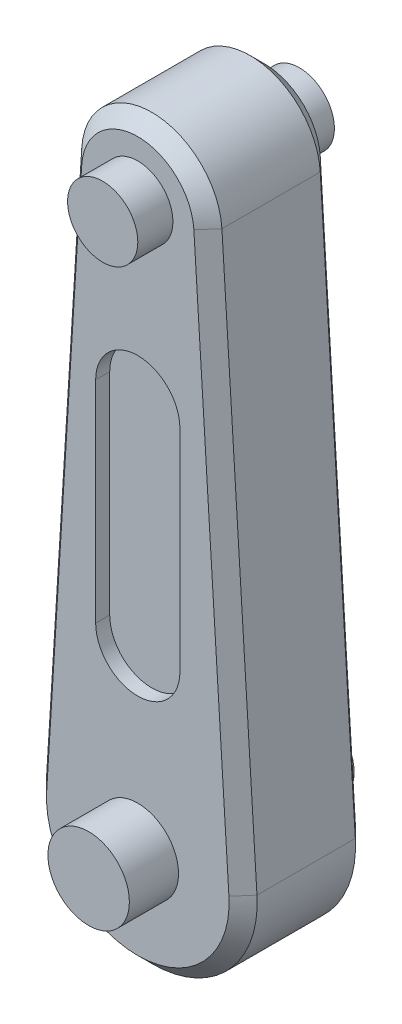
ISO-10303-21;
HEADER;
FILE_DESCRIPTION(('STEP AP214'),'2;1');
FILE_NAME('part.step','',(''),(''),'','','');
FILE_SCHEMA(('AUTOMOTIVE_DESIGN { 1 0 10303 214 1 1 1 1 }'));
ENDSEC;
DATA;
#1=APPLICATION_CONTEXT('core data for automotive mechanical design processes');
#2=APPLICATION_PROTOCOL_DEFINITION('international standard','automotive_design',2000,#1);
#3=PRODUCT_CONTEXT('',#1,'mechanical');
#4=PRODUCT('Part','Part','',(#3));
#5=PRODUCT_RELATED_PRODUCT_CATEGORY('part','',(#4));
#6=PRODUCT_DEFINITION_FORMATION('','',#4);
#7=PRODUCT_DEFINITION_CONTEXT('part definition',#1,'design');
#8=PRODUCT_DEFINITION('design','',#6,#7);
#9=PRODUCT_DEFINITION_SHAPE('','',#8);
#10=(LENGTH_UNIT() NAMED_UNIT(*) SI_UNIT(.MILLI.,.METRE.));
#11=(NAMED_UNIT(*) PLANE_ANGLE_UNIT() SI_UNIT($,.RADIAN.));
#12=(NAMED_UNIT(*) SI_UNIT($,.STERADIAN.) SOLID_ANGLE_UNIT());
#13=UNCERTAINTY_MEASURE_WITH_UNIT(LENGTH_MEASURE(1.E-05),#10,'distance_accuracy_value','');
#14=(GEOMETRIC_REPRESENTATION_CONTEXT(3) GLOBAL_UNCERTAINTY_ASSIGNED_CONTEXT((#13)) GLOBAL_UNIT_ASSIGNED_CONTEXT((#10,
#11,#12)) REPRESENTATION_CONTEXT('',''));
#15=CARTESIAN_POINT('',(0.,0.,0.));
#16=DIRECTION('',(0.,0.,1.));
#17=DIRECTION('',(1.,0.,0.));
#18=AXIS2_PLACEMENT_3D('',#15,#16,#17);
#19=CARTESIAN_POINT('',(0.,0.,-45.));
#20=DIRECTION('',(0.,0.,1.));
#21=DIRECTION('',(1.,0.,0.));
#22=AXIS2_PLACEMENT_3D('',#19,#20,#21);
#23=PLANE('',#22);
#24=CARTESIAN_POINT('',(0.,0.,-45.));
#25=DIRECTION('',(0.,0.,1.));
#26=DIRECTION('',(1.,0.,0.));
#27=AXIS2_PLACEMENT_3D('',#24,#25,#26);
#28=CIRCLE('',#27,29.);
#29=CARTESIAN_POINT('',(29.,0.,-45.));
#30=VERTEX_POINT('',#29);
#31=EDGE_CURVE('E245',#30,#30,#28,.F.);
#32=ORIENTED_EDGE('',*,*,#31,.F.);
#33=EDGE_LOOP('',(#32));
#34=FACE_BOUND('',#33,.T.);
#35=CARTESIAN_POINT('',(0.,400.,-45.));
#36=DIRECTION('',(0.,0.,1.));
#37=DIRECTION('',(1.,0.,0.));
#38=AXIS2_PLACEMENT_3D('',#35,#36,#37);
#39=CIRCLE('',#38,25.);
#40=CARTESIAN_POINT('',(25.,400.,-45.));
#41=VERTEX_POINT('',#40);
#42=EDGE_CURVE('E257',#41,#41,#39,.F.);
#43=ORIENTED_EDGE('',*,*,#42,.F.);
#44=EDGE_LOOP('',(#43));
#45=FACE_BOUND('',#44,.T.);
#46=CARTESIAN_POINT('',(0.,0.,-45.));
#47=DIRECTION('',(0.,0.,1.));
#48=DIRECTION('',(1.,0.,0.));
#49=AXIS2_PLACEMENT_3D('',#46,#47,#48);
#50=CIRCLE('',#49,65.);
#51=CARTESIAN_POINT('',(64.8729226546022,4.0625,-45.));
#52=VERTEX_POINT('',#51);
#53=CARTESIAN_POINT('',(-64.8729226546022,4.0625,-45.));
#54=VERTEX_POINT('',#53);
#55=EDGE_CURVE('E48',#52,#54,#50,.F.);
#56=ORIENTED_EDGE('',*,*,#55,.T.);
#57=DIRECTION('',(0.0625,0.998044963916957,0.));
#58=VECTOR('',#57,1.);
#59=CARTESIAN_POINT('',(-64.8729226546022,4.0625,-45.));
#60=LINE('',#59,#58);
#61=CARTESIAN_POINT('',(-39.9217985566783,402.5,-45.));
#62=VERTEX_POINT('',#61);
#63=EDGE_CURVE('E11',#54,#62,#60,.T.);
#64=ORIENTED_EDGE('',*,*,#63,.T.);
#65=CARTESIAN_POINT('',(0.,400.,-45.));
#66=DIRECTION('',(0.,0.,1.));
#67=DIRECTION('',(1.,0.,0.));
#68=AXIS2_PLACEMENT_3D('',#65,#66,#67);
#69=CIRCLE('',#68,40.);
#70=CARTESIAN_POINT('',(39.9217985566783,402.5,-45.));
#71=VERTEX_POINT('',#70);
#72=EDGE_CURVE('E289',#62,#71,#69,.F.);
#73=ORIENTED_EDGE('',*,*,#72,.T.);
#74=DIRECTION('',(0.0625,-0.998044963916957,0.));
#75=VECTOR('',#74,1.);
#76=CARTESIAN_POINT('',(64.8729226546022,4.0625,-45.));
#77=LINE('',#76,#75);
#78=EDGE_CURVE('E287',#71,#52,#77,.T.);
#79=ORIENTED_EDGE('',*,*,#78,.T.);
#80=EDGE_LOOP('',(#56,#64,#73,#79));
#81=FACE_BOUND('',#80,.T.);
#82=CARTESIAN_POINT('',(0.,275.,-45.));
#83=DIRECTION('',(0.,0.,1.));
#84=DIRECTION('',(1.,0.,0.));
#85=AXIS2_PLACEMENT_3D('',#82,#83,#84);
#86=CIRCLE('',#85,30.);
#87=CARTESIAN_POINT('',(30.,275.,-45.));
#88=VERTEX_POINT('',#87);
#89=CARTESIAN_POINT('',(-30.,275.,-45.));
#90=VERTEX_POINT('',#89);
#91=EDGE_CURVE('E56',#88,#90,#86,.T.);
#92=ORIENTED_EDGE('',*,*,#91,.T.);
#93=DIRECTION('',(0.,-1.,0.));
#94=VECTOR('',#93,1.);
#95=CARTESIAN_POINT('',(-30.,275.,-45.));
#96=LINE('',#95,#94);
#97=CARTESIAN_POINT('',(-30.,125.,-45.));
#98=VERTEX_POINT('',#97);
#99=EDGE_CURVE('E174',#90,#98,#96,.T.);
#100=ORIENTED_EDGE('',*,*,#99,.T.);
#101=CARTESIAN_POINT('',(0.,125.,-45.));
#102=DIRECTION('',(0.,0.,1.));
#103=DIRECTION('',(1.,0.,0.));
#104=AXIS2_PLACEMENT_3D('',#101,#102,#103);
#105=CIRCLE('',#104,30.);
#106=CARTESIAN_POINT('',(30.,125.,-45.));
#107=VERTEX_POINT('',#106);
#108=EDGE_CURVE('E177',#98,#107,#105,.T.);
#109=ORIENTED_EDGE('',*,*,#108,.T.);
#110=DIRECTION('',(0.,1.,0.));
#111=VECTOR('',#110,1.);
#112=CARTESIAN_POINT('',(30.,275.,-45.));
#113=LINE('',#112,#111);
#114=EDGE_CURVE('E183',#107,#88,#113,.T.);
#115=ORIENTED_EDGE('',*,*,#114,.T.);
#116=EDGE_LOOP('',(#92,#100,#109,#115));
#117=FACE_BOUND('',#116,.T.);
#118=ADVANCED_FACE('F38',(#34,#45,#81,#117),#23,.F.);
#119=CARTESIAN_POINT('',(0.,0.,-162.02438661764));
#120=DIRECTION('',(0.,0.,1.));
#121=DIRECTION('',(1.,0.,0.));
#122=AXIS2_PLACEMENT_3D('',#119,#120,#121);
#123=CYLINDRICAL_SURFACE('',#122,29.);
#124=CARTESIAN_POINT('',(0.,0.,45.));
#125=DIRECTION('',(0.,0.,1.));
#126=DIRECTION('',(1.,0.,0.));
#127=AXIS2_PLACEMENT_3D('',#124,#125,#126);
#128=CIRCLE('',#127,29.);
#129=CARTESIAN_POINT('',(29.,0.,45.));
#130=VERTEX_POINT('',#129);
#131=EDGE_CURVE('E252',#130,#130,#128,.F.);
#132=ORIENTED_EDGE('',*,*,#131,.F.);
#133=EDGE_LOOP('',(#132));
#134=FACE_BOUND('',#133,.T.);
#135=CARTESIAN_POINT('',(0.,0.,80.));
#136=DIRECTION('',(0.,0.,1.));
#137=DIRECTION('',(1.,0.,0.));
#138=AXIS2_PLACEMENT_3D('',#135,#136,#137);
#139=CIRCLE('',#138,29.);
#140=CARTESIAN_POINT('',(29.,0.,80.));
#141=VERTEX_POINT('',#140);
#142=EDGE_CURVE('E246',#141,#141,#139,.T.);
#143=ORIENTED_EDGE('',*,*,#142,.F.);
#144=EDGE_LOOP('',(#143));
#145=FACE_BOUND('',#144,.T.);
#146=ADVANCED_FACE('F370',(#134,#145),#123,.T.);
#147=CARTESIAN_POINT('',(0.,0.,80.));
#148=DIRECTION('',(0.,0.,1.));
#149=DIRECTION('',(1.,0.,0.));
#150=AXIS2_PLACEMENT_3D('',#147,#148,#149);
#151=PLANE('',#150);
#152=ORIENTED_EDGE('',*,*,#142,.T.);
#153=EDGE_LOOP('',(#152));
#154=FACE_BOUND('',#153,.T.);
#155=ADVANCED_FACE('F373',(#154),#151,.T.);
#156=CARTESIAN_POINT('',(0.,0.,45.));
#157=DIRECTION('',(0.,0.,-1.));
#158=DIRECTION('',(-1.,0.,0.));
#159=AXIS2_PLACEMENT_3D('',#156,#157,#158);
#160=CYLINDRICAL_SURFACE('',#159,75.);
#161=DIRECTION('',(0.,0.,-1.));
#162=VECTOR('',#161,1.);
#163=CARTESIAN_POINT('',(74.8533722937718,4.6875,45.));
#164=LINE('',#163,#162);
#165=CARTESIAN_POINT('',(74.8533722937718,4.6875,34.9999999999999));
#166=VERTEX_POINT('',#165);
#167=CARTESIAN_POINT('',(74.8533722937718,4.6875,-35.0000000000001));
#168=VERTEX_POINT('',#167);
#169=EDGE_CURVE('E242',#166,#168,#164,.T.);
#170=ORIENTED_EDGE('',*,*,#169,.F.);
#171=CARTESIAN_POINT('',(0.,0.,34.9999999999999));
#172=DIRECTION('',(0.,0.,1.));
#173=DIRECTION('',(1.,0.,0.));
#174=AXIS2_PLACEMENT_3D('',#171,#172,#173);
#175=CIRCLE('',#174,75.);
#176=CARTESIAN_POINT('',(-74.8533722937718,4.68749999999999,34.9999999999999));
#177=VERTEX_POINT('',#176);
#178=EDGE_CURVE('E277',#166,#177,#175,.F.);
#179=ORIENTED_EDGE('',*,*,#178,.T.);
#180=DIRECTION('',(0.,0.,-1.));
#181=VECTOR('',#180,1.);
#182=CARTESIAN_POINT('',(-74.8533722937718,4.68749999999999,45.));
#183=LINE('',#182,#181);
#184=CARTESIAN_POINT('',(-74.8533722937718,4.68749999999999,-35.0000000000001));
#185=VERTEX_POINT('',#184);
#186=EDGE_CURVE('E233',#177,#185,#183,.T.);
#187=ORIENTED_EDGE('',*,*,#186,.T.);
#188=CARTESIAN_POINT('',(0.,0.,-35.0000000000001));
#189=DIRECTION('',(0.,0.,1.));
#190=DIRECTION('',(1.,0.,0.));
#191=AXIS2_PLACEMENT_3D('',#188,#189,#190);
#192=CIRCLE('',#191,75.);
#193=EDGE_CURVE('E275',#185,#168,#192,.T.);
#194=ORIENTED_EDGE('',*,*,#193,.T.);
#195=EDGE_LOOP('',(#170,#179,#187,#194));
#196=FACE_BOUND('',#195,.T.);
#197=ADVANCED_FACE('F334',(#196),#160,.T.);
#198=CARTESIAN_POINT('',(49.9022481958478,403.125,45.));
#199=DIRECTION('',(-0.998044963916957,-0.0625,0.));
#200=DIRECTION('',(0.0625,-0.998044963916957,0.));
#201=AXIS2_PLACEMENT_3D('',#198,#199,#200);
#202=PLANE('',#201);
#203=DIRECTION('',(0.,0.,-1.));
#204=VECTOR('',#203,1.);
#205=CARTESIAN_POINT('',(49.9022481958479,403.125,45.));
#206=LINE('',#205,#204);
#207=CARTESIAN_POINT('',(49.9022481958479,403.125,34.9999999999999));
#208=VERTEX_POINT('',#207);
#209=CARTESIAN_POINT('',(49.9022481958479,403.125,-35.0000000000001));
#210=VERTEX_POINT('',#209);
#211=EDGE_CURVE('E239',#208,#210,#206,.T.);
#212=ORIENTED_EDGE('',*,*,#211,.F.);
#213=DIRECTION('',(0.0625,-0.998044963916957,0.));
#214=VECTOR('',#213,1.);
#215=CARTESIAN_POINT('',(74.8533722937718,4.6875,34.9999999999999));
#216=LINE('',#215,#214);
#217=EDGE_CURVE('E285',#208,#166,#216,.T.);
#218=ORIENTED_EDGE('',*,*,#217,.T.);
#219=ORIENTED_EDGE('',*,*,#169,.T.);
#220=DIRECTION('',(-0.0625,0.998044963916957,0.));
#221=VECTOR('',#220,1.);
#222=CARTESIAN_POINT('',(49.9022481958478,403.125,-35.0000000000001));
#223=LINE('',#222,#221);
#224=EDGE_CURVE('E283',#168,#210,#223,.T.);
#225=ORIENTED_EDGE('',*,*,#224,.T.);
#226=EDGE_LOOP('',(#212,#218,#219,#225));
#227=FACE_BOUND('',#226,.T.);
#228=ADVANCED_FACE('F351',(#227),#202,.F.);
#229=CARTESIAN_POINT('',(0.,400.,45.));
#230=DIRECTION('',(0.,0.,-1.));
#231=DIRECTION('',(-1.,0.,0.));
#232=AXIS2_PLACEMENT_3D('',#229,#230,#231);
#233=CYLINDRICAL_SURFACE('',#232,50.);
#234=DIRECTION('',(0.,0.,-1.));
#235=VECTOR('',#234,1.);
#236=CARTESIAN_POINT('',(-49.9022481958479,403.125,45.));
#237=LINE('',#236,#235);
#238=CARTESIAN_POINT('',(-49.9022481958479,403.125,34.9999999999999));
#239=VERTEX_POINT('',#238);
#240=CARTESIAN_POINT('',(-49.9022481958479,403.125,-35.0000000000001));
#241=VERTEX_POINT('',#240);
#242=EDGE_CURVE('E236',#239,#241,#237,.T.);
#243=ORIENTED_EDGE('',*,*,#242,.F.);
#244=CARTESIAN_POINT('',(0.,400.,34.9999999999999));
#245=DIRECTION('',(0.,0.,1.));
#246=DIRECTION('',(1.,0.,0.));
#247=AXIS2_PLACEMENT_3D('',#244,#245,#246);
#248=CIRCLE('',#247,50.);
#249=EDGE_CURVE('E281',#239,#208,#248,.F.);
#250=ORIENTED_EDGE('',*,*,#249,.T.);
#251=ORIENTED_EDGE('',*,*,#211,.T.);
#252=CARTESIAN_POINT('',(0.,400.,-35.0000000000001));
#253=DIRECTION('',(0.,0.,1.));
#254=DIRECTION('',(1.,0.,0.));
#255=AXIS2_PLACEMENT_3D('',#252,#253,#254);
#256=CIRCLE('',#255,50.);
#257=EDGE_CURVE('E279',#210,#241,#256,.T.);
#258=ORIENTED_EDGE('',*,*,#257,.T.);
#259=EDGE_LOOP('',(#243,#250,#251,#258));
#260=FACE_BOUND('',#259,.T.);
#261=ADVANCED_FACE('F347',(#260),#233,.T.);
#262=CARTESIAN_POINT('',(-74.8533722937718,4.68749999999999,45.));
#263=DIRECTION('',(0.998044963916957,-0.0625,0.));
#264=DIRECTION('',(0.0625,0.998044963916957,0.));
#265=AXIS2_PLACEMENT_3D('',#262,#263,#264);
#266=PLANE('',#265);
#267=ORIENTED_EDGE('',*,*,#186,.F.);
#268=DIRECTION('',(0.0625,0.998044963916957,0.));
#269=VECTOR('',#268,1.);
#270=CARTESIAN_POINT('',(-49.9022481958479,403.125,34.9999999999999));
#271=LINE('',#270,#269);
#272=EDGE_CURVE('E272',#177,#239,#271,.T.);
#273=ORIENTED_EDGE('',*,*,#272,.T.);
#274=ORIENTED_EDGE('',*,*,#242,.T.);
#275=DIRECTION('',(-0.0625,-0.998044963916957,0.));
#276=VECTOR('',#275,1.);
#277=CARTESIAN_POINT('',(-74.8533722937718,4.68749999999999,-35.0000000000001));
#278=LINE('',#277,#276);
#279=EDGE_CURVE('E269',#241,#185,#278,.T.);
#280=ORIENTED_EDGE('',*,*,#279,.T.);
#281=EDGE_LOOP('',(#267,#273,#274,#280));
#282=FACE_BOUND('',#281,.T.);
#283=ADVANCED_FACE('F331',(#282),#266,.F.);
#284=CARTESIAN_POINT('',(0.,0.,45.));
#285=DIRECTION('',(0.,0.,1.));
#286=DIRECTION('',(1.,0.,0.));
#287=AXIS2_PLACEMENT_3D('',#284,#285,#286);
#288=PLANE('',#287);
#289=CARTESIAN_POINT('',(0.,275.,45.));
#290=DIRECTION('',(0.,0.,1.));
#291=DIRECTION('',(1.,0.,0.));
#292=AXIS2_PLACEMENT_3D('',#289,#290,#291);
#293=CIRCLE('',#292,30.);
#294=CARTESIAN_POINT('',(30.,275.,45.));
#295=VERTEX_POINT('',#294);
#296=CARTESIAN_POINT('',(-30.,275.,45.));
#297=VERTEX_POINT('',#296);
#298=EDGE_CURVE('E64',#295,#297,#293,.T.);
#299=ORIENTED_EDGE('',*,*,#298,.F.);
#300=DIRECTION('',(0.,1.,0.));
#301=VECTOR('',#300,1.);
#302=CARTESIAN_POINT('',(30.,275.,45.));
#303=LINE('',#302,#301);
#304=CARTESIAN_POINT('',(30.,125.,45.));
#305=VERTEX_POINT('',#304);
#306=EDGE_CURVE('E196',#305,#295,#303,.T.);
#307=ORIENTED_EDGE('',*,*,#306,.F.);
#308=CARTESIAN_POINT('',(0.,125.,45.));
#309=DIRECTION('',(0.,0.,1.));
#310=DIRECTION('',(1.,0.,0.));
#311=AXIS2_PLACEMENT_3D('',#308,#309,#310);
#312=CIRCLE('',#311,30.);
#313=CARTESIAN_POINT('',(-30.,125.,45.));
#314=VERTEX_POINT('',#313);
#315=EDGE_CURVE('E210',#314,#305,#312,.T.);
#316=ORIENTED_EDGE('',*,*,#315,.F.);
#317=DIRECTION('',(0.,-1.,0.));
#318=VECTOR('',#317,1.);
#319=CARTESIAN_POINT('',(-30.,275.,45.));
#320=LINE('',#319,#318);
#321=EDGE_CURVE('E207',#297,#314,#320,.T.);
#322=ORIENTED_EDGE('',*,*,#321,.F.);
#323=EDGE_LOOP('',(#299,#307,#316,#322));
#324=FACE_BOUND('',#323,.T.);
#325=CARTESIAN_POINT('',(0.,400.,45.));
#326=DIRECTION('',(0.,0.,1.));
#327=DIRECTION('',(1.,0.,0.));
#328=AXIS2_PLACEMENT_3D('',#325,#326,#327);
#329=CIRCLE('',#328,40.);
#330=CARTESIAN_POINT('',(39.9217985566782,402.5,45.));
#331=VERTEX_POINT('',#330);
#332=CARTESIAN_POINT('',(-39.9217985566782,402.5,45.));
#333=VERTEX_POINT('',#332);
#334=EDGE_CURVE('E262',#331,#333,#329,.T.);
#335=ORIENTED_EDGE('',*,*,#334,.T.);
#336=DIRECTION('',(-0.0625,-0.998044963916957,0.));
#337=VECTOR('',#336,1.);
#338=CARTESIAN_POINT('',(-64.8729226546022,4.06249999999999,45.));
#339=LINE('',#338,#337);
#340=CARTESIAN_POINT('',(-64.8729226546022,4.06249999999999,45.));
#341=VERTEX_POINT('',#340);
#342=EDGE_CURVE('E266',#333,#341,#339,.T.);
#343=ORIENTED_EDGE('',*,*,#342,.T.);
#344=CARTESIAN_POINT('',(0.,0.,45.));
#345=DIRECTION('',(0.,0.,1.));
#346=DIRECTION('',(1.,0.,0.));
#347=AXIS2_PLACEMENT_3D('',#344,#345,#346);
#348=CIRCLE('',#347,65.);
#349=CARTESIAN_POINT('',(64.8729226546022,4.0625,45.));
#350=VERTEX_POINT('',#349);
#351=EDGE_CURVE('E264',#341,#350,#348,.T.);
#352=ORIENTED_EDGE('',*,*,#351,.T.);
#353=DIRECTION('',(-0.0625,0.998044963916957,0.));
#354=VECTOR('',#353,1.);
#355=CARTESIAN_POINT('',(39.9217985566782,402.5,45.));
#356=LINE('',#355,#354);
#357=EDGE_CURVE('E260',#350,#331,#356,.T.);
#358=ORIENTED_EDGE('',*,*,#357,.T.);
#359=EDGE_LOOP('',(#335,#343,#352,#358));
#360=FACE_BOUND('',#359,.T.);
#361=CARTESIAN_POINT('',(0.,400.,45.));
#362=DIRECTION('',(0.,0.,1.));
#363=DIRECTION('',(1.,0.,0.));
#364=AXIS2_PLACEMENT_3D('',#361,#362,#363);
#365=CIRCLE('',#364,25.);
#366=CARTESIAN_POINT('',(25.,400.,45.));
#367=VERTEX_POINT('',#366);
#368=EDGE_CURVE('E226',#367,#367,#365,.F.);
#369=ORIENTED_EDGE('',*,*,#368,.T.);
#370=EDGE_LOOP('',(#369));
#371=FACE_BOUND('',#370,.T.);
#372=ORIENTED_EDGE('',*,*,#131,.T.);
#373=EDGE_LOOP('',(#372));
#374=FACE_BOUND('',#373,.T.);
#375=ADVANCED_FACE('F360',(#324,#360,#371,#374),#288,.T.);
#376=CARTESIAN_POINT('',(-115.,-165.,-80.));
#377=DIRECTION('',(0.,0.,1.));
#378=DIRECTION('',(1.,0.,0.));
#379=AXIS2_PLACEMENT_3D('',#376,#377,#378);
#380=PLANE('',#379);
#381=CARTESIAN_POINT('',(0.,0.,-80.));
#382=DIRECTION('',(0.,0.,1.));
#383=DIRECTION('',(1.,0.,0.));
#384=AXIS2_PLACEMENT_3D('',#381,#382,#383);
#385=CIRCLE('',#384,29.);
#386=CARTESIAN_POINT('',(29.,0.,-80.));
#387=VERTEX_POINT('',#386);
#388=EDGE_CURVE('E249',#387,#387,#385,.F.);
#389=ORIENTED_EDGE('',*,*,#388,.T.);
#390=EDGE_LOOP('',(#389));
#391=FACE_BOUND('',#390,.T.);
#392=ADVANCED_FACE('F363',(#391),#380,.F.);
#393=ORIENTED_EDGE('',*,*,#388,.F.);
#394=EDGE_LOOP('',(#393));
#395=FACE_BOUND('',#394,.T.);
#396=ORIENTED_EDGE('',*,*,#31,.T.);
#397=EDGE_LOOP('',(#396));
#398=FACE_BOUND('',#397,.T.);
#399=ADVANCED_FACE('F375',(#395,#398),#123,.T.);
#400=CARTESIAN_POINT('',(0.,400.,-70.));
#401=DIRECTION('',(0.,0.,1.));
#402=DIRECTION('',(1.,0.,0.));
#403=AXIS2_PLACEMENT_3D('',#400,#401,#402);
#404=PLANE('',#403);
#405=CARTESIAN_POINT('',(0.,400.,-70.));
#406=DIRECTION('',(0.,0.,1.));
#407=DIRECTION('',(1.,0.,0.));
#408=AXIS2_PLACEMENT_3D('',#405,#406,#407);
#409=CIRCLE('',#408,25.);
#410=CARTESIAN_POINT('',(25.,400.,-70.));
#411=VERTEX_POINT('',#410);
#412=EDGE_CURVE('E227',#411,#411,#409,.T.);
#413=ORIENTED_EDGE('',*,*,#412,.F.);
#414=EDGE_LOOP('',(#413));
#415=FACE_BOUND('',#414,.T.);
#416=ADVANCED_FACE('F404',(#415),#404,.F.);
#417=CARTESIAN_POINT('',(0.,400.,70.));
#418=DIRECTION('',(0.,0.,-1.));
#419=DIRECTION('',(-1.,0.,0.));
#420=AXIS2_PLACEMENT_3D('',#417,#418,#419);
#421=CYLINDRICAL_SURFACE('',#420,25.);
#422=ORIENTED_EDGE('',*,*,#412,.T.);
#423=EDGE_LOOP('',(#422));
#424=FACE_BOUND('',#423,.T.);
#425=ORIENTED_EDGE('',*,*,#42,.T.);
#426=EDGE_LOOP('',(#425));
#427=FACE_BOUND('',#426,.T.);
#428=ADVANCED_FACE('F411',(#424,#427),#421,.T.);
#429=ORIENTED_EDGE('',*,*,#368,.F.);
#430=EDGE_LOOP('',(#429));
#431=FACE_BOUND('',#430,.T.);
#432=CARTESIAN_POINT('',(0.,400.,70.));
#433=DIRECTION('',(0.,0.,1.));
#434=DIRECTION('',(1.,0.,0.));
#435=AXIS2_PLACEMENT_3D('',#432,#433,#434);
#436=CIRCLE('',#435,25.);
#437=CARTESIAN_POINT('',(25.,400.,70.));
#438=VERTEX_POINT('',#437);
#439=EDGE_CURVE('E223',#438,#438,#436,.T.);
#440=ORIENTED_EDGE('',*,*,#439,.F.);
#441=EDGE_LOOP('',(#440));
#442=FACE_BOUND('',#441,.T.);
#443=ADVANCED_FACE('F482',(#431,#442),#421,.T.);
#444=CARTESIAN_POINT('',(0.,400.,70.));
#445=DIRECTION('',(0.,0.,1.));
#446=DIRECTION('',(1.,0.,0.));
#447=AXIS2_PLACEMENT_3D('',#444,#445,#446);
#448=PLANE('',#447);
#449=ORIENTED_EDGE('',*,*,#439,.T.);
#450=EDGE_LOOP('',(#449));
#451=FACE_BOUND('',#450,.T.);
#452=ADVANCED_FACE('F435',(#451),#448,.T.);
#453=CARTESIAN_POINT('',(64.8729226546022,4.0625,45.));
#454=DIRECTION('',(0.705724361914765,0.0441941738241593,0.707106781186546));
#455=DIRECTION('',(0.0625,-0.998044963916957,0.));
#456=AXIS2_PLACEMENT_3D('',#453,#454,#455);
#457=PLANE('',#456);
#458=DIRECTION('',(-0.705724361914762,-0.0441941738241591,0.707106781186549));
#459=VECTOR('',#458,1.);
#460=CARTESIAN_POINT('',(74.8533722937718,4.6875,34.9999999999999));
#461=LINE('',#460,#459);
#462=EDGE_CURVE('E296',#166,#350,#461,.T.);
#463=ORIENTED_EDGE('',*,*,#462,.F.);
#464=ORIENTED_EDGE('',*,*,#217,.F.);
#465=DIRECTION('',(0.705724361914762,0.0441941738241581,-0.707106781186549));
#466=VECTOR('',#465,1.);
#467=CARTESIAN_POINT('',(39.9217985566782,402.5,45.));
#468=LINE('',#467,#466);
#469=EDGE_CURVE('E230',#331,#208,#468,.T.);
#470=ORIENTED_EDGE('',*,*,#469,.F.);
#471=ORIENTED_EDGE('',*,*,#357,.F.);
#472=EDGE_LOOP('',(#463,#464,#470,#471));
#473=FACE_BOUND('',#472,.T.);
#474=ADVANCED_FACE('F354',(#473),#457,.T.);
#475=CARTESIAN_POINT('',(0.,400.,45.));
#476=DIRECTION('',(0.,0.,-1.));
#477=DIRECTION('',(-1.,0.,0.));
#478=AXIS2_PLACEMENT_3D('',#475,#476,#477);
#479=CONICAL_SURFACE('',#478,40.,0.785398163397447);
#480=ORIENTED_EDGE('',*,*,#469,.T.);
#481=ORIENTED_EDGE('',*,*,#249,.F.);
#482=DIRECTION('',(-0.705724361914763,0.0441941738241581,-0.707106781186548));
#483=VECTOR('',#482,1.);
#484=CARTESIAN_POINT('',(-39.9217985566782,402.5,45.));
#485=LINE('',#484,#483);
#486=EDGE_CURVE('E294',#333,#239,#485,.T.);
#487=ORIENTED_EDGE('',*,*,#486,.F.);
#488=ORIENTED_EDGE('',*,*,#334,.F.);
#489=EDGE_LOOP('',(#480,#481,#487,#488));
#490=FACE_BOUND('',#489,.T.);
#491=ADVANCED_FACE('F358',(#490),#479,.T.);
#492=CARTESIAN_POINT('',(0.,0.,45.));
#493=DIRECTION('',(0.,0.,-1.));
#494=DIRECTION('',(-1.,0.,0.));
#495=AXIS2_PLACEMENT_3D('',#492,#493,#494);
#496=CONICAL_SURFACE('',#495,65.,0.785398163397447);
#497=ORIENTED_EDGE('',*,*,#462,.T.);
#498=ORIENTED_EDGE('',*,*,#351,.F.);
#499=DIRECTION('',(0.705724361914763,-0.0441941738241592,0.707106781186548));
#500=VECTOR('',#499,1.);
#501=CARTESIAN_POINT('',(-74.8533722937718,4.68749999999999,34.9999999999999));
#502=LINE('',#501,#500);
#503=EDGE_CURVE('E292',#177,#341,#502,.T.);
#504=ORIENTED_EDGE('',*,*,#503,.F.);
#505=ORIENTED_EDGE('',*,*,#178,.F.);
#506=EDGE_LOOP('',(#497,#498,#504,#505));
#507=FACE_BOUND('',#506,.T.);
#508=ADVANCED_FACE('F339',(#507),#496,.T.);
#509=CARTESIAN_POINT('',(-64.8729226546022,4.0625,45.));
#510=DIRECTION('',(-0.705724361914765,0.0441941738241593,0.707106781186546));
#511=DIRECTION('',(0.0625,0.998044963916957,0.));
#512=AXIS2_PLACEMENT_3D('',#509,#510,#511);
#513=PLANE('',#512);
#514=ORIENTED_EDGE('',*,*,#486,.T.);
#515=ORIENTED_EDGE('',*,*,#272,.F.);
#516=ORIENTED_EDGE('',*,*,#503,.T.);
#517=ORIENTED_EDGE('',*,*,#342,.F.);
#518=EDGE_LOOP('',(#514,#515,#516,#517));
#519=FACE_BOUND('',#518,.T.);
#520=ADVANCED_FACE('F343',(#519),#513,.T.);
#521=CARTESIAN_POINT('',(49.9022481958478,403.125,-35.0000000000001));
#522=DIRECTION('',(-0.705724361914761,-0.0441941738241591,0.70710678118655));
#523=DIRECTION('',(-0.0625,0.998044963916957,0.));
#524=AXIS2_PLACEMENT_3D('',#521,#522,#523);
#525=PLANE('',#524);
#526=DIRECTION('',(0.705724361914766,0.0441941738241594,0.707106781186545));
#527=VECTOR('',#526,1.);
#528=CARTESIAN_POINT('',(64.8729226546022,4.0625,-45.));
#529=LINE('',#528,#527);
#530=EDGE_CURVE('E303',#52,#168,#529,.T.);
#531=ORIENTED_EDGE('',*,*,#530,.F.);
#532=ORIENTED_EDGE('',*,*,#78,.F.);
#533=DIRECTION('',(-0.705724361914766,-0.0441941738241586,-0.707106781186545));
#534=VECTOR('',#533,1.);
#535=CARTESIAN_POINT('',(49.9022481958478,403.125,-35.0000000000001));
#536=LINE('',#535,#534);
#537=EDGE_CURVE('E43',#210,#71,#536,.T.);
#538=ORIENTED_EDGE('',*,*,#537,.F.);
#539=ORIENTED_EDGE('',*,*,#224,.F.);
#540=EDGE_LOOP('',(#531,#532,#538,#539));
#541=FACE_BOUND('',#540,.T.);
#542=ADVANCED_FACE('F41',(#541),#525,.F.);
#543=CARTESIAN_POINT('',(0.,400.,-35.0000000000001));
#544=DIRECTION('',(0.,0.,1.));
#545=DIRECTION('',(1.,0.,0.));
#546=AXIS2_PLACEMENT_3D('',#543,#544,#545);
#547=CONICAL_SURFACE('',#546,50.,0.785398163397452);
#548=ORIENTED_EDGE('',*,*,#537,.T.);
#549=ORIENTED_EDGE('',*,*,#72,.F.);
#550=DIRECTION('',(0.705724361914766,-0.0441941738241586,-0.707106781186545));
#551=VECTOR('',#550,1.);
#552=CARTESIAN_POINT('',(-49.9022481958478,403.125,-35.0000000000001));
#553=LINE('',#552,#551);
#554=EDGE_CURVE('E302',#241,#62,#553,.T.);
#555=ORIENTED_EDGE('',*,*,#554,.F.);
#556=ORIENTED_EDGE('',*,*,#257,.F.);
#557=EDGE_LOOP('',(#548,#549,#555,#556));
#558=FACE_BOUND('',#557,.T.);
#559=ADVANCED_FACE('F314',(#558),#547,.T.);
#560=CARTESIAN_POINT('',(0.,0.,-35.0000000000001));
#561=DIRECTION('',(0.,0.,1.));
#562=DIRECTION('',(1.,0.,0.));
#563=AXIS2_PLACEMENT_3D('',#560,#561,#562);
#564=CONICAL_SURFACE('',#563,75.,0.785398163397452);
#565=ORIENTED_EDGE('',*,*,#530,.T.);
#566=ORIENTED_EDGE('',*,*,#193,.F.);
#567=DIRECTION('',(-0.705724361914765,0.0441941738241593,0.707106781186545));
#568=VECTOR('',#567,1.);
#569=CARTESIAN_POINT('',(-64.8729226546022,4.0625,-45.));
#570=LINE('',#569,#568);
#571=EDGE_CURVE('E217',#54,#185,#570,.T.);
#572=ORIENTED_EDGE('',*,*,#571,.F.);
#573=ORIENTED_EDGE('',*,*,#55,.F.);
#574=EDGE_LOOP('',(#565,#566,#572,#573));
#575=FACE_BOUND('',#574,.T.);
#576=ADVANCED_FACE('F326',(#575),#564,.T.);
#577=CARTESIAN_POINT('',(-74.8533722937718,4.68749999999999,-35.0000000000001));
#578=DIRECTION('',(0.705724361914761,-0.0441941738241591,0.70710678118655));
#579=DIRECTION('',(-0.0625,-0.998044963916957,0.));
#580=AXIS2_PLACEMENT_3D('',#577,#578,#579);
#581=PLANE('',#580);
#582=ORIENTED_EDGE('',*,*,#554,.T.);
#583=ORIENTED_EDGE('',*,*,#63,.F.);
#584=ORIENTED_EDGE('',*,*,#571,.T.);
#585=ORIENTED_EDGE('',*,*,#279,.F.);
#586=EDGE_LOOP('',(#582,#583,#584,#585));
#587=FACE_BOUND('',#586,.T.);
#588=ADVANCED_FACE('F324',(#587),#581,.F.);
#589=CARTESIAN_POINT('',(0.,275.,35.));
#590=DIRECTION('',(0.,0.,1.));
#591=DIRECTION('',(1.,0.,0.));
#592=AXIS2_PLACEMENT_3D('',#589,#590,#591);
#593=CYLINDRICAL_SURFACE('',#592,30.);
#594=ORIENTED_EDGE('',*,*,#298,.T.);
#595=DIRECTION('',(0.,0.,1.));
#596=VECTOR('',#595,1.);
#597=CARTESIAN_POINT('',(-30.,275.,35.));
#598=LINE('',#597,#596);
#599=CARTESIAN_POINT('',(-30.,275.,35.));
#600=VERTEX_POINT('',#599);
#601=EDGE_CURVE('E205',#600,#297,#598,.T.);
#602=ORIENTED_EDGE('',*,*,#601,.F.);
#603=CARTESIAN_POINT('',(0.,275.,35.));
#604=DIRECTION('',(0.,0.,1.));
#605=DIRECTION('',(1.,0.,0.));
#606=AXIS2_PLACEMENT_3D('',#603,#604,#605);
#607=CIRCLE('',#606,30.);
#608=CARTESIAN_POINT('',(30.,275.,35.));
#609=VERTEX_POINT('',#608);
#610=EDGE_CURVE('E192',#609,#600,#607,.T.);
#611=ORIENTED_EDGE('',*,*,#610,.F.);
#612=DIRECTION('',(0.,0.,1.));
#613=VECTOR('',#612,1.);
#614=CARTESIAN_POINT('',(30.,275.,35.));
#615=LINE('',#614,#613);
#616=EDGE_CURVE('E215',#609,#295,#615,.T.);
#617=ORIENTED_EDGE('',*,*,#616,.T.);
#618=EDGE_LOOP('',(#594,#602,#611,#617));
#619=FACE_BOUND('',#618,.T.);
#620=ADVANCED_FACE('F442',(#619),#593,.F.);
#621=CARTESIAN_POINT('',(30.,275.,35.));
#622=DIRECTION('',(1.,0.,0.));
#623=DIRECTION('',(0.,1.,0.));
#624=AXIS2_PLACEMENT_3D('',#621,#622,#623);
#625=PLANE('',#624);
#626=ORIENTED_EDGE('',*,*,#306,.T.);
#627=ORIENTED_EDGE('',*,*,#616,.F.);
#628=DIRECTION('',(0.,1.,0.));
#629=VECTOR('',#628,1.);
#630=CARTESIAN_POINT('',(30.,275.,35.));
#631=LINE('',#630,#629);
#632=CARTESIAN_POINT('',(30.,125.,35.));
#633=VERTEX_POINT('',#632);
#634=EDGE_CURVE('E202',#633,#609,#631,.T.);
#635=ORIENTED_EDGE('',*,*,#634,.F.);
#636=DIRECTION('',(0.,0.,1.));
#637=VECTOR('',#636,1.);
#638=CARTESIAN_POINT('',(30.,125.,35.));
#639=LINE('',#638,#637);
#640=EDGE_CURVE('E218',#633,#305,#639,.T.);
#641=ORIENTED_EDGE('',*,*,#640,.T.);
#642=EDGE_LOOP('',(#626,#627,#635,#641));
#643=FACE_BOUND('',#642,.T.);
#644=ADVANCED_FACE('F586',(#643),#625,.F.);
#645=CARTESIAN_POINT('',(0.,125.,35.));
#646=DIRECTION('',(0.,0.,1.));
#647=DIRECTION('',(1.,0.,0.));
#648=AXIS2_PLACEMENT_3D('',#645,#646,#647);
#649=CYLINDRICAL_SURFACE('',#648,30.);
#650=ORIENTED_EDGE('',*,*,#315,.T.);
#651=ORIENTED_EDGE('',*,*,#640,.F.);
#652=CARTESIAN_POINT('',(0.,125.,35.));
#653=DIRECTION('',(0.,0.,1.));
#654=DIRECTION('',(1.,0.,0.));
#655=AXIS2_PLACEMENT_3D('',#652,#653,#654);
#656=CIRCLE('',#655,30.);
#657=CARTESIAN_POINT('',(-30.,125.,35.));
#658=VERTEX_POINT('',#657);
#659=EDGE_CURVE('E199',#658,#633,#656,.T.);
#660=ORIENTED_EDGE('',*,*,#659,.F.);
#661=DIRECTION('',(0.,0.,1.));
#662=VECTOR('',#661,1.);
#663=CARTESIAN_POINT('',(-30.,125.,35.));
#664=LINE('',#663,#662);
#665=EDGE_CURVE('E220',#658,#314,#664,.T.);
#666=ORIENTED_EDGE('',*,*,#665,.T.);
#667=EDGE_LOOP('',(#650,#651,#660,#666));
#668=FACE_BOUND('',#667,.T.);
#669=ADVANCED_FACE('F594',(#668),#649,.F.);
#670=CARTESIAN_POINT('',(-30.,275.,35.));
#671=DIRECTION('',(-1.,0.,0.));
#672=DIRECTION('',(0.,-1.,0.));
#673=AXIS2_PLACEMENT_3D('',#670,#671,#672);
#674=PLANE('',#673);
#675=ORIENTED_EDGE('',*,*,#321,.T.);
#676=ORIENTED_EDGE('',*,*,#665,.F.);
#677=DIRECTION('',(0.,-1.,0.));
#678=VECTOR('',#677,1.);
#679=CARTESIAN_POINT('',(-30.,275.,35.));
#680=LINE('',#679,#678);
#681=EDGE_CURVE('E195',#600,#658,#680,.T.);
#682=ORIENTED_EDGE('',*,*,#681,.F.);
#683=ORIENTED_EDGE('',*,*,#601,.T.);
#684=EDGE_LOOP('',(#675,#676,#682,#683));
#685=FACE_BOUND('',#684,.T.);
#686=ADVANCED_FACE('F603',(#685),#674,.F.);
#687=CARTESIAN_POINT('',(0.,275.,35.));
#688=DIRECTION('',(0.,0.,1.));
#689=DIRECTION('',(1.,0.,0.));
#690=AXIS2_PLACEMENT_3D('',#687,#688,#689);
#691=PLANE('',#690);
#692=ORIENTED_EDGE('',*,*,#610,.T.);
#693=ORIENTED_EDGE('',*,*,#681,.T.);
#694=ORIENTED_EDGE('',*,*,#659,.T.);
#695=ORIENTED_EDGE('',*,*,#634,.T.);
#696=EDGE_LOOP('',(#692,#693,#694,#695));
#697=FACE_BOUND('',#696,.T.);
#698=ADVANCED_FACE('F612',(#697),#691,.T.);
#699=CARTESIAN_POINT('',(0.,275.,-35.));
#700=DIRECTION('',(0.,0.,-1.));
#701=DIRECTION('',(-1.,0.,0.));
#702=AXIS2_PLACEMENT_3D('',#699,#700,#701);
#703=CYLINDRICAL_SURFACE('',#702,30.);
#704=ORIENTED_EDGE('',*,*,#91,.F.);
#705=DIRECTION('',(0.,0.,-1.));
#706=VECTOR('',#705,1.);
#707=CARTESIAN_POINT('',(30.,275.,-35.));
#708=LINE('',#707,#706);
#709=CARTESIAN_POINT('',(30.,275.,-35.));
#710=VERTEX_POINT('',#709);
#711=EDGE_CURVE('E159',#710,#88,#708,.T.);
#712=ORIENTED_EDGE('',*,*,#711,.F.);
#713=CARTESIAN_POINT('',(0.,275.,-35.));
#714=DIRECTION('',(0.,0.,1.));
#715=DIRECTION('',(1.,0.,0.));
#716=AXIS2_PLACEMENT_3D('',#713,#714,#715);
#717=CIRCLE('',#716,30.);
#718=CARTESIAN_POINT('',(-30.,275.,-35.));
#719=VERTEX_POINT('',#718);
#720=EDGE_CURVE('E166',#710,#719,#717,.T.);
#721=ORIENTED_EDGE('',*,*,#720,.T.);
#722=DIRECTION('',(0.,0.,-1.));
#723=VECTOR('',#722,1.);
#724=CARTESIAN_POINT('',(-30.,275.,-35.));
#725=LINE('',#724,#723);
#726=EDGE_CURVE('E187',#719,#90,#725,.T.);
#727=ORIENTED_EDGE('',*,*,#726,.T.);
#728=EDGE_LOOP('',(#704,#712,#721,#727));
#729=FACE_BOUND('',#728,.T.);
#730=ADVANCED_FACE('F169',(#729),#703,.F.);
#731=CARTESIAN_POINT('',(-30.,275.,-35.));
#732=DIRECTION('',(1.,0.,0.));
#733=DIRECTION('',(0.,1.,0.));
#734=AXIS2_PLACEMENT_3D('',#731,#732,#733);
#735=PLANE('',#734);
#736=ORIENTED_EDGE('',*,*,#99,.F.);
#737=ORIENTED_EDGE('',*,*,#726,.F.);
#738=DIRECTION('',(0.,-1.,0.));
#739=VECTOR('',#738,1.);
#740=CARTESIAN_POINT('',(-30.,275.,-35.));
#741=LINE('',#740,#739);
#742=CARTESIAN_POINT('',(-30.,125.,-35.));
#743=VERTEX_POINT('',#742);
#744=EDGE_CURVE('E171',#719,#743,#741,.T.);
#745=ORIENTED_EDGE('',*,*,#744,.T.);
#746=DIRECTION('',(0.,0.,-1.));
#747=VECTOR('',#746,1.);
#748=CARTESIAN_POINT('',(-30.,125.,-35.));
#749=LINE('',#748,#747);
#750=EDGE_CURVE('E189',#743,#98,#749,.T.);
#751=ORIENTED_EDGE('',*,*,#750,.T.);
#752=EDGE_LOOP('',(#736,#737,#745,#751));
#753=FACE_BOUND('',#752,.T.);
#754=ADVANCED_FACE('F629',(#753),#735,.T.);
#755=CARTESIAN_POINT('',(0.,125.,-35.));
#756=DIRECTION('',(0.,0.,-1.));
#757=DIRECTION('',(-1.,0.,0.));
#758=AXIS2_PLACEMENT_3D('',#755,#756,#757);
#759=CYLINDRICAL_SURFACE('',#758,30.);
#760=ORIENTED_EDGE('',*,*,#108,.F.);
#761=ORIENTED_EDGE('',*,*,#750,.F.);
#762=CARTESIAN_POINT('',(0.,125.,-35.));
#763=DIRECTION('',(0.,0.,1.));
#764=DIRECTION('',(1.,0.,0.));
#765=AXIS2_PLACEMENT_3D('',#762,#763,#764);
#766=CIRCLE('',#765,30.);
#767=CARTESIAN_POINT('',(30.,125.,-35.));
#768=VERTEX_POINT('',#767);
#769=EDGE_CURVE('E165',#743,#768,#766,.T.);
#770=ORIENTED_EDGE('',*,*,#769,.T.);
#771=DIRECTION('',(0.,0.,-1.));
#772=VECTOR('',#771,1.);
#773=CARTESIAN_POINT('',(30.,125.,-35.));
#774=LINE('',#773,#772);
#775=EDGE_CURVE('E161',#768,#107,#774,.T.);
#776=ORIENTED_EDGE('',*,*,#775,.T.);
#777=EDGE_LOOP('',(#760,#761,#770,#776));
#778=FACE_BOUND('',#777,.T.);
#779=ADVANCED_FACE('F637',(#778),#759,.F.);
#780=CARTESIAN_POINT('',(30.,275.,-35.));
#781=DIRECTION('',(-1.,0.,0.));
#782=DIRECTION('',(0.,-1.,0.));
#783=AXIS2_PLACEMENT_3D('',#780,#781,#782);
#784=PLANE('',#783);
#785=ORIENTED_EDGE('',*,*,#114,.F.);
#786=ORIENTED_EDGE('',*,*,#775,.F.);
#787=DIRECTION('',(0.,1.,0.));
#788=VECTOR('',#787,1.);
#789=CARTESIAN_POINT('',(30.,275.,-35.));
#790=LINE('',#789,#788);
#791=EDGE_CURVE('E156',#768,#710,#790,.T.);
#792=ORIENTED_EDGE('',*,*,#791,.T.);
#793=ORIENTED_EDGE('',*,*,#711,.T.);
#794=EDGE_LOOP('',(#785,#786,#792,#793));
#795=FACE_BOUND('',#794,.T.);
#796=ADVANCED_FACE('F158',(#795),#784,.T.);
#797=CARTESIAN_POINT('',(0.,275.,-35.));
#798=DIRECTION('',(0.,0.,-1.));
#799=DIRECTION('',(1.,0.,0.));
#800=AXIS2_PLACEMENT_3D('',#797,#798,#799);
#801=PLANE('',#800);
#802=ORIENTED_EDGE('',*,*,#720,.F.);
#803=ORIENTED_EDGE('',*,*,#791,.F.);
#804=ORIENTED_EDGE('',*,*,#769,.F.);
#805=ORIENTED_EDGE('',*,*,#744,.F.);
#806=EDGE_LOOP('',(#802,#803,#804,#805));
#807=FACE_BOUND('',#806,.T.);
#808=ADVANCED_FACE('F173',(#807),#801,.T.);
#809=CLOSED_SHELL('',(#118,#146,#155,#197,#228,#261,#283,#375,#392,#399,#416,#428,#443,#452,
#474,#491,#508,#520,#542,#559,#576,#588,#620,#644,#669,#686,#698,#730,#754,#779,#796,#808));
#810=MANIFOLD_SOLID_BREP('B2',#809);
#811=ADVANCED_BREP_SHAPE_REPRESENTATION('',(#18,#810),#14);
#812=SHAPE_DEFINITION_REPRESENTATION(#9,#811);
ENDSEC;
END-ISO-10303-21;
